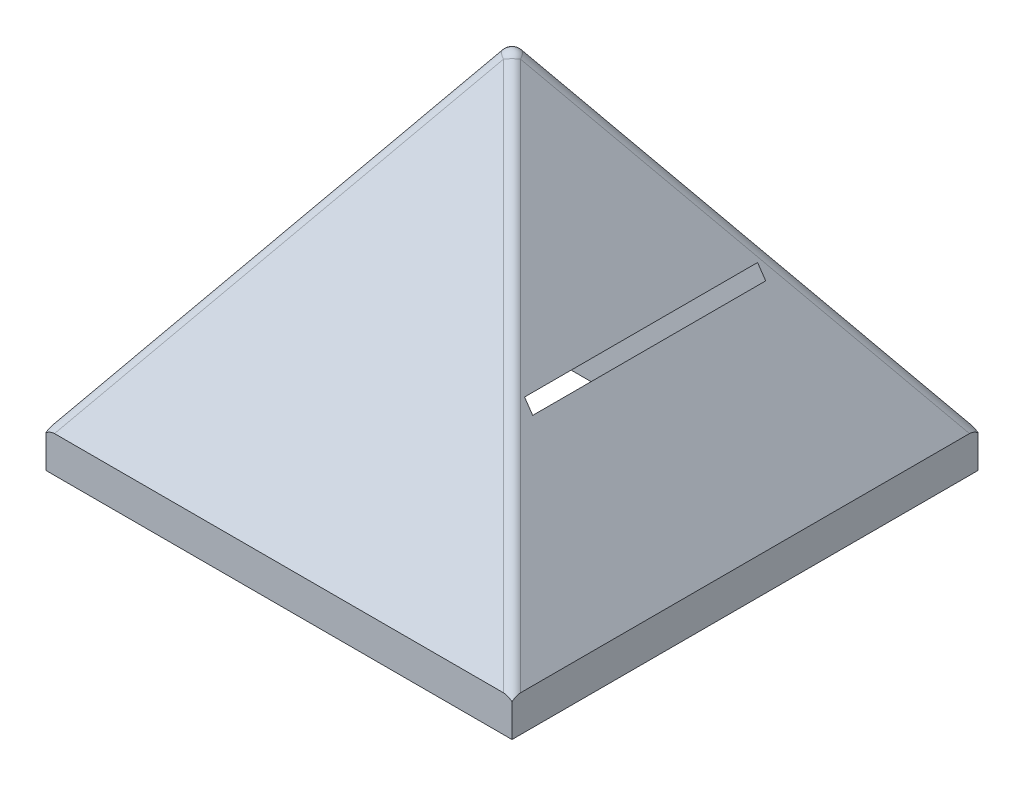
ISO-10303-21;
HEADER;
FILE_DESCRIPTION(('STEP AP214'),'2;1');
FILE_NAME('part.step','',(''),(''),'','','');
FILE_SCHEMA(('AUTOMOTIVE_DESIGN { 1 0 10303 214 1 1 1 1 }'));
ENDSEC;
DATA;
#1=APPLICATION_CONTEXT('core data for automotive mechanical design processes');
#2=APPLICATION_PROTOCOL_DEFINITION('international standard','automotive_design',2000,#1);
#3=PRODUCT_CONTEXT('',#1,'mechanical');
#4=PRODUCT('Part','Part','',(#3));
#5=PRODUCT_RELATED_PRODUCT_CATEGORY('part','',(#4));
#6=PRODUCT_DEFINITION_FORMATION('','',#4);
#7=PRODUCT_DEFINITION_CONTEXT('part definition',#1,'design');
#8=PRODUCT_DEFINITION('design','',#6,#7);
#9=PRODUCT_DEFINITION_SHAPE('','',#8);
#10=(LENGTH_UNIT() NAMED_UNIT(*) SI_UNIT(.MILLI.,.METRE.));
#11=(NAMED_UNIT(*) PLANE_ANGLE_UNIT() SI_UNIT($,.RADIAN.));
#12=(NAMED_UNIT(*) SI_UNIT($,.STERADIAN.) SOLID_ANGLE_UNIT());
#13=UNCERTAINTY_MEASURE_WITH_UNIT(LENGTH_MEASURE(1.E-05),#10,'distance_accuracy_value','');
#14=(GEOMETRIC_REPRESENTATION_CONTEXT(3) GLOBAL_UNCERTAINTY_ASSIGNED_CONTEXT((#13)) GLOBAL_UNIT_ASSIGNED_CONTEXT((#10,
#11,#12)) REPRESENTATION_CONTEXT('',''));
#15=CARTESIAN_POINT('',(0.,0.,0.));
#16=DIRECTION('',(0.,0.,1.));
#17=DIRECTION('',(1.,0.,0.));
#18=AXIS2_PLACEMENT_3D('',#15,#16,#17);
#19=CARTESIAN_POINT('',(-1143.,1828.8,-1143.));
#20=DIRECTION('',(0.,0.,1.));
#21=DIRECTION('',(1.,0.,0.));
#22=AXIS2_PLACEMENT_3D('',#19,#20,#21);
#23=PLANE('',#22);
#24=DIRECTION('',(-1.,0.,0.));
#25=VECTOR('',#24,1.);
#26=CARTESIAN_POINT('',(1143.,177.8,-1143.));
#27=LINE('',#26,#25);
#28=CARTESIAN_POINT('',(1101.2326366645,177.8,-1143.));
#29=VERTEX_POINT('',#28);
#30=CARTESIAN_POINT('',(-1101.2326366645,177.8,-1143.));
#31=VERTEX_POINT('',#30);
#32=EDGE_CURVE('E241',#29,#31,#27,.T.);
#33=ORIENTED_EDGE('',*,*,#32,.F.);
#34=CARTESIAN_POINT('',(1143.,88.5534971463589,-1143.));
#35=DIRECTION('',(0.,0.,1.));
#36=DIRECTION('',(-0.569209978830308,0.822192191643779,0.));
#37=AXIS2_PLACEMENT_3D('',#34,#35,#36);
#38=ELLIPSE('',#37,102.691666027993,50.8);
#39=CARTESIAN_POINT('',(1143.,161.167470566097,-1143.));
#40=VERTEX_POINT('',#39);
#41=EDGE_CURVE('E278',#29,#40,#38,.F.);
#42=ORIENTED_EDGE('',*,*,#41,.T.);
#43=DIRECTION('',(0.,-1.,0.));
#44=VECTOR('',#43,1.);
#45=CARTESIAN_POINT('',(1143.,1828.8,-1143.));
#46=LINE('',#45,#44);
#47=CARTESIAN_POINT('',(1143.,0.,-1143.));
#48=VERTEX_POINT('',#47);
#49=EDGE_CURVE('E267',#40,#48,#46,.T.);
#50=ORIENTED_EDGE('',*,*,#49,.T.);
#51=DIRECTION('',(-1.,0.,0.));
#52=VECTOR('',#51,1.);
#53=CARTESIAN_POINT('',(-1143.,0.,-1143.));
#54=LINE('',#53,#52);
#55=CARTESIAN_POINT('',(-1143.,0.,-1143.));
#56=VERTEX_POINT('',#55);
#57=EDGE_CURVE('E252',#48,#56,#54,.T.);
#58=ORIENTED_EDGE('',*,*,#57,.T.);
#59=DIRECTION('',(0.,-1.,0.));
#60=VECTOR('',#59,1.);
#61=CARTESIAN_POINT('',(-1143.,1828.8,-1143.));
#62=LINE('',#61,#60);
#63=CARTESIAN_POINT('',(-1143.,161.167470566097,-1143.));
#64=VERTEX_POINT('',#63);
#65=EDGE_CURVE('E265',#64,#56,#62,.T.);
#66=ORIENTED_EDGE('',*,*,#65,.F.);
#67=CARTESIAN_POINT('',(-1143.,88.5534971463589,-1143.));
#68=DIRECTION('',(0.,0.,1.));
#69=DIRECTION('',(-0.569209978830308,-0.822192191643779,0.));
#70=AXIS2_PLACEMENT_3D('',#67,#68,#69);
#71=ELLIPSE('',#70,102.691666027993,50.8);
#72=EDGE_CURVE('E276',#64,#31,#71,.F.);
#73=ORIENTED_EDGE('',*,*,#72,.T.);
#74=EDGE_LOOP('',(#33,#42,#50,#58,#66,#73));
#75=FACE_BOUND('',#74,.T.);
#76=ADVANCED_FACE('F69',(#75),#23,.F.);
#77=CARTESIAN_POINT('',(-855.8784,592.5312,-1143.));
#78=DIRECTION('',(-0.822192191643779,0.569209978830308,0.));
#79=DIRECTION('',(-0.569209978830308,-0.822192191643779,0.));
#80=AXIS2_PLACEMENT_3D('',#77,#78,#79);
#81=PLANE('',#80);
#82=DIRECTION('',(0.,0.,1.));
#83=VECTOR('',#82,1.);
#84=CARTESIAN_POINT('',(-673.1,856.544444444445,-1143.));
#85=LINE('',#84,#83);
#86=CARTESIAN_POINT('',(-673.1,856.544444444445,-571.5));
#87=VERTEX_POINT('',#86);
#88=CARTESIAN_POINT('',(-673.1,856.544444444445,571.5));
#89=VERTEX_POINT('',#88);
#90=EDGE_CURVE('E233',#87,#89,#85,.T.);
#91=ORIENTED_EDGE('',*,*,#90,.F.);
#92=DIRECTION('',(-0.569209978830308,-0.822192191643779,0.));
#93=VECTOR('',#92,1.);
#94=CARTESIAN_POINT('',(-855.8784,592.5312,-571.5));
#95=LINE('',#94,#93);
#96=CARTESIAN_POINT('',(-633.046153846154,914.4,-571.5));
#97=VERTEX_POINT('',#96);
#98=EDGE_CURVE('E224',#97,#87,#95,.T.);
#99=ORIENTED_EDGE('',*,*,#98,.F.);
#100=DIRECTION('',(0.,0.,1.));
#101=VECTOR('',#100,1.);
#102=CARTESIAN_POINT('',(-633.046153846154,914.4,-1143.));
#103=LINE('',#102,#101);
#104=CARTESIAN_POINT('',(-633.046153846154,914.4,571.5));
#105=VERTEX_POINT('',#104);
#106=EDGE_CURVE('E235',#97,#105,#103,.T.);
#107=ORIENTED_EDGE('',*,*,#106,.T.);
#108=DIRECTION('',(0.569209978830308,0.822192191643779,0.));
#109=VECTOR('',#108,1.);
#110=CARTESIAN_POINT('',(-855.8784,592.5312,571.5));
#111=LINE('',#110,#109);
#112=EDGE_CURVE('E230',#89,#105,#111,.T.);
#113=ORIENTED_EDGE('',*,*,#112,.F.);
#114=EDGE_LOOP('',(#91,#99,#107,#113));
#115=FACE_BOUND('',#114,.T.);
#116=DIRECTION('',(-0.494684738936381,-0.714544622908107,0.494684738936381));
#117=VECTOR('',#116,1.);
#118=CARTESIAN_POINT('',(-10.2210164053655,1814.03630963669,-31.5463469301387));
#119=LINE('',#118,#117);
#120=CARTESIAN_POINT('',(-1143.,177.8,1101.2326366645));
#121=VERTEX_POINT('',#120);
#122=CARTESIAN_POINT('',(-41.7673633355044,1768.46936407094,2.11914167990519E-13));
#123=VERTEX_POINT('',#122);
#124=EDGE_CURVE('E86',#121,#123,#119,.F.);
#125=ORIENTED_EDGE('',*,*,#124,.T.);
#126=DIRECTION('',(-0.494684738936382,-0.714544622908107,-0.494684738936381));
#127=VECTOR('',#126,1.);
#128=CARTESIAN_POINT('',(-936.361801903855,476.277397249988,-894.59443856835));
#129=LINE('',#128,#127);
#130=CARTESIAN_POINT('',(-1143.,177.8,-1101.2326366645));
#131=VERTEX_POINT('',#130);
#132=EDGE_CURVE('E297',#123,#131,#129,.T.);
#133=ORIENTED_EDGE('',*,*,#132,.T.);
#134=DIRECTION('',(0.,0.,1.));
#135=VECTOR('',#134,1.);
#136=CARTESIAN_POINT('',(-1143.,177.8,-1143.));
#137=LINE('',#136,#135);
#138=EDGE_CURVE('E247',#131,#121,#137,.T.);
#139=ORIENTED_EDGE('',*,*,#138,.T.);
#140=EDGE_LOOP('',(#125,#133,#139));
#141=FACE_BOUND('',#140,.T.);
#142=ADVANCED_FACE('F330',(#115,#141),#81,.T.);
#143=CARTESIAN_POINT('',(855.8784,592.5312,-1143.));
#144=DIRECTION('',(-0.822192191643779,-0.569209978830308,0.));
#145=DIRECTION('',(0.569209978830308,-0.822192191643779,0.));
#146=AXIS2_PLACEMENT_3D('',#143,#144,#145);
#147=PLANE('',#146);
#148=DIRECTION('',(0.,0.,1.));
#149=VECTOR('',#148,1.);
#150=CARTESIAN_POINT('',(673.1,856.544444444444,-1143.));
#151=LINE('',#150,#149);
#152=CARTESIAN_POINT('',(673.1,856.544444444444,-571.5));
#153=VERTEX_POINT('',#152);
#154=CARTESIAN_POINT('',(673.1,856.544444444444,571.5));
#155=VERTEX_POINT('',#154);
#156=EDGE_CURVE('E192',#153,#155,#151,.T.);
#157=ORIENTED_EDGE('',*,*,#156,.T.);
#158=DIRECTION('',(-0.569209978830308,0.822192191643779,0.));
#159=VECTOR('',#158,1.);
#160=CARTESIAN_POINT('',(855.8784,592.5312,571.5));
#161=LINE('',#160,#159);
#162=CARTESIAN_POINT('',(633.046153846154,914.4,571.5));
#163=VERTEX_POINT('',#162);
#164=EDGE_CURVE('E227',#155,#163,#161,.T.);
#165=ORIENTED_EDGE('',*,*,#164,.T.);
#166=DIRECTION('',(0.,0.,1.));
#167=VECTOR('',#166,1.);
#168=CARTESIAN_POINT('',(633.046153846154,914.4,-1143.));
#169=LINE('',#168,#167);
#170=CARTESIAN_POINT('',(633.046153846154,914.4,-571.5));
#171=VERTEX_POINT('',#170);
#172=EDGE_CURVE('E269',#171,#163,#169,.T.);
#173=ORIENTED_EDGE('',*,*,#172,.F.);
#174=DIRECTION('',(0.569209978830308,-0.822192191643779,0.));
#175=VECTOR('',#174,1.);
#176=CARTESIAN_POINT('',(855.8784,592.5312,-571.5));
#177=LINE('',#176,#175);
#178=EDGE_CURVE('E219',#171,#153,#177,.T.);
#179=ORIENTED_EDGE('',*,*,#178,.T.);
#180=EDGE_LOOP('',(#157,#165,#173,#179));
#181=FACE_BOUND('',#180,.T.);
#182=DIRECTION('',(0.,0.,1.));
#183=VECTOR('',#182,1.);
#184=CARTESIAN_POINT('',(1143.,177.8,-1143.));
#185=LINE('',#184,#183);
#186=CARTESIAN_POINT('',(1143.,177.8,-1101.2326366645));
#187=VERTEX_POINT('',#186);
#188=CARTESIAN_POINT('',(1143.,177.8,1101.2326366645));
#189=VERTEX_POINT('',#188);
#190=EDGE_CURVE('E244',#187,#189,#185,.T.);
#191=ORIENTED_EDGE('',*,*,#190,.F.);
#192=DIRECTION('',(0.494684738936381,-0.714544622908107,-0.494684738936381));
#193=VECTOR('',#192,1.);
#194=CARTESIAN_POINT('',(10.2210164053649,1814.0363096367,31.546346930139));
#195=LINE('',#194,#193);
#196=CARTESIAN_POINT('',(41.7673633355036,1768.46936407094,3.24601045405236E-13));
#197=VERTEX_POINT('',#196);
#198=EDGE_CURVE('E286',#187,#197,#195,.F.);
#199=ORIENTED_EDGE('',*,*,#198,.T.);
#200=DIRECTION('',(0.494684738936382,-0.714544622908107,0.494684738936381));
#201=VECTOR('',#200,1.);
#202=CARTESIAN_POINT('',(376.947904622888,1284.3196933225,335.180541287384));
#203=LINE('',#202,#201);
#204=EDGE_CURVE('E284',#197,#189,#203,.T.);
#205=ORIENTED_EDGE('',*,*,#204,.T.);
#206=EDGE_LOOP('',(#191,#199,#205));
#207=FACE_BOUND('',#206,.T.);
#208=ADVANCED_FACE('F322',(#181,#207),#147,.F.);
#209=CARTESIAN_POINT('',(-1143.,1828.8,1143.));
#210=DIRECTION('',(1.,0.,0.));
#211=DIRECTION('',(0.,0.,-1.));
#212=AXIS2_PLACEMENT_3D('',#209,#210,#211);
#213=PLANE('',#212);
#214=ORIENTED_EDGE('',*,*,#138,.F.);
#215=CARTESIAN_POINT('',(-1143.,88.5534971463589,-1143.));
#216=DIRECTION('',(1.,0.,0.));
#217=DIRECTION('',(0.,-0.822192191643779,-0.569209978830308));
#218=AXIS2_PLACEMENT_3D('',#215,#216,#217);
#219=ELLIPSE('',#218,102.691666027993,50.8);
#220=EDGE_CURVE('E12',#131,#64,#219,.F.);
#221=ORIENTED_EDGE('',*,*,#220,.T.);
#222=ORIENTED_EDGE('',*,*,#65,.T.);
#223=DIRECTION('',(0.,0.,1.));
#224=VECTOR('',#223,1.);
#225=CARTESIAN_POINT('',(-1143.,0.,1143.));
#226=LINE('',#225,#224);
#227=CARTESIAN_POINT('',(-1143.,0.,1143.));
#228=VERTEX_POINT('',#227);
#229=EDGE_CURVE('E255',#56,#228,#226,.T.);
#230=ORIENTED_EDGE('',*,*,#229,.T.);
#231=DIRECTION('',(0.,-1.,0.));
#232=VECTOR('',#231,1.);
#233=CARTESIAN_POINT('',(-1143.,1828.8,1143.));
#234=LINE('',#233,#232);
#235=CARTESIAN_POINT('',(-1143.,161.167470566097,1143.));
#236=VERTEX_POINT('',#235);
#237=EDGE_CURVE('E263',#236,#228,#234,.T.);
#238=ORIENTED_EDGE('',*,*,#237,.F.);
#239=CARTESIAN_POINT('',(-1143.,88.5534971463584,1143.));
#240=DIRECTION('',(1.,0.,0.));
#241=DIRECTION('',(0.,0.822192191643779,-0.569209978830308));
#242=AXIS2_PLACEMENT_3D('',#239,#240,#241);
#243=ELLIPSE('',#242,102.691666027993,50.8);
#244=EDGE_CURVE('E78',#236,#121,#243,.F.);
#245=ORIENTED_EDGE('',*,*,#244,.T.);
#246=EDGE_LOOP('',(#214,#221,#222,#230,#238,#245));
#247=FACE_BOUND('',#246,.T.);
#248=ADVANCED_FACE('F352',(#247),#213,.F.);
#249=CARTESIAN_POINT('',(-1143.,1828.8,1143.));
#250=DIRECTION('',(0.,0.,-1.));
#251=DIRECTION('',(-1.,0.,0.));
#252=AXIS2_PLACEMENT_3D('',#249,#250,#251);
#253=PLANE('',#252);
#254=DIRECTION('',(0.,-1.,0.));
#255=VECTOR('',#254,1.);
#256=CARTESIAN_POINT('',(1143.,1828.8,1143.));
#257=LINE('',#256,#255);
#258=CARTESIAN_POINT('',(1143.,161.167470566097,1143.));
#259=VERTEX_POINT('',#258);
#260=CARTESIAN_POINT('',(1143.,0.,1143.));
#261=VERTEX_POINT('',#260);
#262=EDGE_CURVE('E261',#259,#261,#257,.T.);
#263=ORIENTED_EDGE('',*,*,#262,.F.);
#264=CARTESIAN_POINT('',(1143.,88.5534971463589,1143.));
#265=DIRECTION('',(0.,0.,-1.));
#266=DIRECTION('',(0.569209978830308,-0.822192191643779,0.));
#267=AXIS2_PLACEMENT_3D('',#264,#265,#266);
#268=ELLIPSE('',#267,102.691666027993,50.8);
#269=CARTESIAN_POINT('',(1101.2326366645,177.8,1143.));
#270=VERTEX_POINT('',#269);
#271=EDGE_CURVE('E290',#259,#270,#268,.F.);
#272=ORIENTED_EDGE('',*,*,#271,.T.);
#273=DIRECTION('',(-1.,0.,0.));
#274=VECTOR('',#273,1.);
#275=CARTESIAN_POINT('',(1143.,177.8,1143.));
#276=LINE('',#275,#274);
#277=CARTESIAN_POINT('',(-1101.2326366645,177.8,1143.));
#278=VERTEX_POINT('',#277);
#279=EDGE_CURVE('E238',#270,#278,#276,.T.);
#280=ORIENTED_EDGE('',*,*,#279,.T.);
#281=CARTESIAN_POINT('',(-1143.,88.5534971463584,1143.));
#282=DIRECTION('',(0.,0.,-1.));
#283=DIRECTION('',(0.569209978830308,0.822192191643779,0.));
#284=AXIS2_PLACEMENT_3D('',#281,#282,#283);
#285=ELLIPSE('',#284,102.691666027993,50.8);
#286=EDGE_CURVE('E288',#278,#236,#285,.F.);
#287=ORIENTED_EDGE('',*,*,#286,.T.);
#288=ORIENTED_EDGE('',*,*,#237,.T.);
#289=DIRECTION('',(1.,0.,0.));
#290=VECTOR('',#289,1.);
#291=CARTESIAN_POINT('',(-1143.,0.,1143.));
#292=LINE('',#291,#290);
#293=EDGE_CURVE('E258',#228,#261,#292,.T.);
#294=ORIENTED_EDGE('',*,*,#293,.T.);
#295=EDGE_LOOP('',(#263,#272,#280,#287,#288,#294));
#296=FACE_BOUND('',#295,.T.);
#297=ADVANCED_FACE('F357',(#296),#253,.F.);
#298=CARTESIAN_POINT('',(1143.,1828.8,1143.));
#299=DIRECTION('',(-1.,0.,0.));
#300=DIRECTION('',(0.,0.,1.));
#301=AXIS2_PLACEMENT_3D('',#298,#299,#300);
#302=PLANE('',#301);
#303=ORIENTED_EDGE('',*,*,#49,.F.);
#304=CARTESIAN_POINT('',(1143.,88.5534971463589,-1143.));
#305=DIRECTION('',(-1.,0.,0.));
#306=DIRECTION('',(0.,0.822192191643779,0.569209978830308));
#307=AXIS2_PLACEMENT_3D('',#304,#305,#306);
#308=ELLIPSE('',#307,102.691666027993,50.8);
#309=EDGE_CURVE('E282',#40,#187,#308,.F.);
#310=ORIENTED_EDGE('',*,*,#309,.T.);
#311=ORIENTED_EDGE('',*,*,#190,.T.);
#312=CARTESIAN_POINT('',(1143.,88.5534971463589,1143.));
#313=DIRECTION('',(-1.,0.,0.));
#314=DIRECTION('',(0.,-0.822192191643779,0.569209978830308));
#315=AXIS2_PLACEMENT_3D('',#312,#313,#314);
#316=ELLIPSE('',#315,102.691666027993,50.8);
#317=EDGE_CURVE('E280',#189,#259,#316,.F.);
#318=ORIENTED_EDGE('',*,*,#317,.T.);
#319=ORIENTED_EDGE('',*,*,#262,.T.);
#320=DIRECTION('',(0.,0.,-1.));
#321=VECTOR('',#320,1.);
#322=CARTESIAN_POINT('',(1143.,0.,1143.));
#323=LINE('',#322,#321);
#324=EDGE_CURVE('E249',#261,#48,#323,.T.);
#325=ORIENTED_EDGE('',*,*,#324,.T.);
#326=EDGE_LOOP('',(#303,#310,#311,#318,#319,#325));
#327=FACE_BOUND('',#326,.T.);
#328=ADVANCED_FACE('F354',(#327),#302,.F.);
#329=CARTESIAN_POINT('',(0.,0.,0.));
#330=DIRECTION('',(0.,-1.,0.));
#331=DIRECTION('',(0.,0.,-1.));
#332=AXIS2_PLACEMENT_3D('',#329,#330,#331);
#333=PLANE('',#332);
#334=DIRECTION('',(0.,0.,-1.));
#335=VECTOR('',#334,1.);
#336=CARTESIAN_POINT('',(-673.1,0.,-571.5));
#337=LINE('',#336,#335);
#338=CARTESIAN_POINT('',(-673.1,0.,571.5));
#339=VERTEX_POINT('',#338);
#340=CARTESIAN_POINT('',(-673.1,0.,-571.5));
#341=VERTEX_POINT('',#340);
#342=EDGE_CURVE('E206',#339,#341,#337,.T.);
#343=ORIENTED_EDGE('',*,*,#342,.F.);
#344=DIRECTION('',(-1.,0.,0.));
#345=VECTOR('',#344,1.);
#346=CARTESIAN_POINT('',(673.1,0.,571.5));
#347=LINE('',#346,#345);
#348=CARTESIAN_POINT('',(673.1,0.,571.5));
#349=VERTEX_POINT('',#348);
#350=EDGE_CURVE('E211',#349,#339,#347,.T.);
#351=ORIENTED_EDGE('',*,*,#350,.F.);
#352=DIRECTION('',(0.,0.,1.));
#353=VECTOR('',#352,1.);
#354=CARTESIAN_POINT('',(673.1,0.,-571.5));
#355=LINE('',#354,#353);
#356=CARTESIAN_POINT('',(673.1,0.,-571.5));
#357=VERTEX_POINT('',#356);
#358=EDGE_CURVE('E189',#357,#349,#355,.T.);
#359=ORIENTED_EDGE('',*,*,#358,.F.);
#360=DIRECTION('',(1.,0.,0.));
#361=VECTOR('',#360,1.);
#362=CARTESIAN_POINT('',(673.1,0.,-571.5));
#363=LINE('',#362,#361);
#364=EDGE_CURVE('E201',#341,#357,#363,.T.);
#365=ORIENTED_EDGE('',*,*,#364,.F.);
#366=EDGE_LOOP('',(#343,#351,#359,#365));
#367=FACE_BOUND('',#366,.T.);
#368=ORIENTED_EDGE('',*,*,#324,.F.);
#369=ORIENTED_EDGE('',*,*,#293,.F.);
#370=ORIENTED_EDGE('',*,*,#229,.F.);
#371=ORIENTED_EDGE('',*,*,#57,.F.);
#372=EDGE_LOOP('',(#368,#369,#370,#371));
#373=FACE_BOUND('',#372,.T.);
#374=ADVANCED_FACE('F208',(#367,#373),#333,.T.);
#375=CARTESIAN_POINT('',(1143.,592.5312,-855.8784));
#376=DIRECTION('',(0.,0.569209978830308,-0.822192191643779));
#377=DIRECTION('',(0.,0.822192191643779,0.569209978830308));
#378=AXIS2_PLACEMENT_3D('',#375,#376,#377);
#379=PLANE('',#378);
#380=DIRECTION('',(-0.494684738936381,-0.714544622908107,-0.494684738936381));
#381=VECTOR('',#380,1.);
#382=CARTESIAN_POINT('',(-335.180541287384,1284.3196933225,-376.947904622888));
#383=LINE('',#382,#381);
#384=CARTESIAN_POINT('',(-2.08796968477753E-13,1768.46936407094,-41.7673633355037));
#385=VERTEX_POINT('',#384);
#386=EDGE_CURVE('E271',#31,#385,#383,.F.);
#387=ORIENTED_EDGE('',*,*,#386,.T.);
#388=DIRECTION('',(0.494684738936381,-0.714544622908107,-0.494684738936381));
#389=VECTOR('',#388,1.);
#390=CARTESIAN_POINT('',(1111.45365306986,163.036309636695,-1153.22101640536));
#391=LINE('',#390,#389);
#392=EDGE_CURVE('E273',#385,#29,#391,.T.);
#393=ORIENTED_EDGE('',*,*,#392,.T.);
#394=ORIENTED_EDGE('',*,*,#32,.T.);
#395=EDGE_LOOP('',(#387,#393,#394));
#396=FACE_BOUND('',#395,.T.);
#397=ADVANCED_FACE('F390',(#396),#379,.T.);
#398=CARTESIAN_POINT('',(1143.,592.5312,855.8784));
#399=DIRECTION('',(0.,-0.569209978830308,-0.822192191643779));
#400=DIRECTION('',(0.,0.822192191643779,-0.569209978830308));
#401=AXIS2_PLACEMENT_3D('',#398,#399,#400);
#402=PLANE('',#401);
#403=ORIENTED_EDGE('',*,*,#279,.F.);
#404=DIRECTION('',(0.494684738936381,-0.714544622908107,0.494684738936381));
#405=VECTOR('',#404,1.);
#406=CARTESIAN_POINT('',(894.59443856835,476.277397249988,936.361801903855));
#407=LINE('',#406,#405);
#408=CARTESIAN_POINT('',(0.,1768.46936407094,41.7673633355043));
#409=VERTEX_POINT('',#408);
#410=EDGE_CURVE('E294',#270,#409,#407,.F.);
#411=ORIENTED_EDGE('',*,*,#410,.T.);
#412=DIRECTION('',(-0.494684738936381,-0.714544622908107,0.494684738936381));
#413=VECTOR('',#412,1.);
#414=CARTESIAN_POINT('',(-1111.45365306986,163.036309636695,1153.22101640537));
#415=LINE('',#414,#413);
#416=EDGE_CURVE('E292',#409,#278,#415,.T.);
#417=ORIENTED_EDGE('',*,*,#416,.T.);
#418=EDGE_LOOP('',(#403,#411,#417));
#419=FACE_BOUND('',#418,.T.);
#420=ADVANCED_FACE('F388',(#419),#402,.F.);
#421=CARTESIAN_POINT('',(0.,914.4,0.));
#422=DIRECTION('',(0.,-1.,0.));
#423=DIRECTION('',(0.,0.,-1.));
#424=AXIS2_PLACEMENT_3D('',#421,#422,#423);
#425=PLANE('',#424);
#426=DIRECTION('',(1.,0.,0.));
#427=VECTOR('',#426,1.);
#428=CARTESIAN_POINT('',(673.1,914.4,-571.5));
#429=LINE('',#428,#427);
#430=EDGE_CURVE('E213',#97,#171,#429,.T.);
#431=ORIENTED_EDGE('',*,*,#430,.T.);
#432=ORIENTED_EDGE('',*,*,#172,.T.);
#433=DIRECTION('',(-1.,0.,0.));
#434=VECTOR('',#433,1.);
#435=CARTESIAN_POINT('',(673.1,914.4,571.5));
#436=LINE('',#435,#434);
#437=EDGE_CURVE('E222',#163,#105,#436,.T.);
#438=ORIENTED_EDGE('',*,*,#437,.T.);
#439=ORIENTED_EDGE('',*,*,#106,.F.);
#440=EDGE_LOOP('',(#431,#432,#438,#439));
#441=FACE_BOUND('',#440,.T.);
#442=ADVANCED_FACE('F317',(#441),#425,.T.);
#443=CARTESIAN_POINT('',(673.1,914.4,571.5));
#444=DIRECTION('',(0.,0.,1.));
#445=DIRECTION('',(1.,0.,0.));
#446=AXIS2_PLACEMENT_3D('',#443,#444,#445);
#447=PLANE('',#446);
#448=ORIENTED_EDGE('',*,*,#112,.T.);
#449=ORIENTED_EDGE('',*,*,#437,.F.);
#450=ORIENTED_EDGE('',*,*,#164,.F.);
#451=DIRECTION('',(0.,-1.,0.));
#452=VECTOR('',#451,1.);
#453=CARTESIAN_POINT('',(673.1,914.4,571.5));
#454=LINE('',#453,#452);
#455=EDGE_CURVE('E196',#155,#349,#454,.T.);
#456=ORIENTED_EDGE('',*,*,#455,.T.);
#457=ORIENTED_EDGE('',*,*,#350,.T.);
#458=DIRECTION('',(0.,-1.,0.));
#459=VECTOR('',#458,1.);
#460=CARTESIAN_POINT('',(-673.1,914.4,571.5));
#461=LINE('',#460,#459);
#462=EDGE_CURVE('E217',#89,#339,#461,.T.);
#463=ORIENTED_EDGE('',*,*,#462,.F.);
#464=EDGE_LOOP('',(#448,#449,#450,#456,#457,#463));
#465=FACE_BOUND('',#464,.T.);
#466=ADVANCED_FACE('F325',(#465),#447,.F.);
#467=CARTESIAN_POINT('',(673.1,914.4,-571.5));
#468=DIRECTION('',(1.,0.,0.));
#469=DIRECTION('',(0.,0.,-1.));
#470=AXIS2_PLACEMENT_3D('',#467,#468,#469);
#471=PLANE('',#470);
#472=DIRECTION('',(0.,-1.,0.));
#473=VECTOR('',#472,1.);
#474=CARTESIAN_POINT('',(673.1,914.4,-571.5));
#475=LINE('',#474,#473);
#476=EDGE_CURVE('E184',#153,#357,#475,.T.);
#477=ORIENTED_EDGE('',*,*,#476,.T.);
#478=ORIENTED_EDGE('',*,*,#358,.T.);
#479=ORIENTED_EDGE('',*,*,#455,.F.);
#480=ORIENTED_EDGE('',*,*,#156,.F.);
#481=EDGE_LOOP('',(#477,#478,#479,#480));
#482=FACE_BOUND('',#481,.T.);
#483=ADVANCED_FACE('F186',(#482),#471,.F.);
#484=CARTESIAN_POINT('',(673.1,914.4,-571.5));
#485=DIRECTION('',(0.,0.,-1.));
#486=DIRECTION('',(-1.,0.,0.));
#487=AXIS2_PLACEMENT_3D('',#484,#485,#486);
#488=PLANE('',#487);
#489=ORIENTED_EDGE('',*,*,#98,.T.);
#490=DIRECTION('',(0.,-1.,0.));
#491=VECTOR('',#490,1.);
#492=CARTESIAN_POINT('',(-673.1,914.4,-571.5));
#493=LINE('',#492,#491);
#494=EDGE_CURVE('E197',#87,#341,#493,.T.);
#495=ORIENTED_EDGE('',*,*,#494,.T.);
#496=ORIENTED_EDGE('',*,*,#364,.T.);
#497=ORIENTED_EDGE('',*,*,#476,.F.);
#498=ORIENTED_EDGE('',*,*,#178,.F.);
#499=ORIENTED_EDGE('',*,*,#430,.F.);
#500=EDGE_LOOP('',(#489,#495,#496,#497,#498,#499));
#501=FACE_BOUND('',#500,.T.);
#502=ADVANCED_FACE('F202',(#501),#488,.F.);
#503=CARTESIAN_POINT('',(-673.1,914.4,-571.5));
#504=DIRECTION('',(-1.,0.,0.));
#505=DIRECTION('',(0.,0.,1.));
#506=AXIS2_PLACEMENT_3D('',#503,#504,#505);
#507=PLANE('',#506);
#508=ORIENTED_EDGE('',*,*,#90,.T.);
#509=ORIENTED_EDGE('',*,*,#462,.T.);
#510=ORIENTED_EDGE('',*,*,#342,.T.);
#511=ORIENTED_EDGE('',*,*,#494,.F.);
#512=EDGE_LOOP('',(#508,#509,#510,#511));
#513=FACE_BOUND('',#512,.T.);
#514=ADVANCED_FACE('F331',(#513),#507,.F.);
#515=CARTESIAN_POINT('',(335.180541287384,1255.40382639792,335.180541287384));
#516=DIRECTION('',(0.494684738936381,-0.714544622908107,0.494684738936381));
#517=DIRECTION('',(0.,-0.569209978830308,-0.822192191643779));
#518=AXIS2_PLACEMENT_3D('',#515,#516,#517);
#519=CYLINDRICAL_SURFACE('',#518,50.8);
#520=ORIENTED_EDGE('',*,*,#317,.F.);
#521=ORIENTED_EDGE('',*,*,#204,.F.);
#522=CARTESIAN_POINT('',(0.,1739.55349714636,3.67761376907083E-13));
#523=DIRECTION('',(-0.49468473893639,0.714544622908102,-0.494684738936379));
#524=DIRECTION('',(-0.822192191643772,-0.569209978830318,0.));
#525=AXIS2_PLACEMENT_3D('',#522,#523,#524);
#526=CIRCLE('',#525,50.8);
#527=EDGE_CURVE('E73',#409,#197,#526,.T.);
#528=ORIENTED_EDGE('',*,*,#527,.F.);
#529=ORIENTED_EDGE('',*,*,#410,.F.);
#530=ORIENTED_EDGE('',*,*,#271,.F.);
#531=EDGE_LOOP('',(#520,#521,#528,#529,#530));
#532=FACE_BOUND('',#531,.T.);
#533=ADVANCED_FACE('F71',(#532),#519,.T.);
#534=CARTESIAN_POINT('',(-335.180541287384,1255.40382639792,335.180541287384));
#535=DIRECTION('',(0.494684738936381,0.714544622908107,-0.494684738936381));
#536=DIRECTION('',(0.,0.569209978830308,0.822192191643779));
#537=AXIS2_PLACEMENT_3D('',#534,#535,#536);
#538=CYLINDRICAL_SURFACE('',#537,50.8);
#539=ORIENTED_EDGE('',*,*,#286,.F.);
#540=ORIENTED_EDGE('',*,*,#416,.F.);
#541=CARTESIAN_POINT('',(-4.16333634234434E-13,1739.55349714636,2.11914167990519E-13));
#542=DIRECTION('',(0.494684738936381,0.714544622908105,-0.494684738936383));
#543=DIRECTION('',(0.,0.56920997883031,0.822192191643777));
#544=AXIS2_PLACEMENT_3D('',#541,#542,#543);
#545=CIRCLE('',#544,50.8);
#546=EDGE_CURVE('E305',#123,#409,#545,.T.);
#547=ORIENTED_EDGE('',*,*,#546,.F.);
#548=ORIENTED_EDGE('',*,*,#124,.F.);
#549=ORIENTED_EDGE('',*,*,#244,.F.);
#550=EDGE_LOOP('',(#539,#540,#547,#548,#549));
#551=FACE_BOUND('',#550,.T.);
#552=ADVANCED_FACE('F338',(#551),#538,.T.);
#553=CARTESIAN_POINT('',(-894.594438568351,447.361530325408,-894.59443856835));
#554=DIRECTION('',(-0.494684738936381,-0.714544622908107,-0.494684738936381));
#555=DIRECTION('',(0.,0.569209978830308,-0.822192191643779));
#556=AXIS2_PLACEMENT_3D('',#553,#554,#555);
#557=CYLINDRICAL_SURFACE('',#556,50.8);
#558=ORIENTED_EDGE('',*,*,#220,.F.);
#559=ORIENTED_EDGE('',*,*,#132,.F.);
#560=CARTESIAN_POINT('',(-2.08796968477753E-13,1739.55349714636,2.91433543964104E-13));
#561=DIRECTION('',(0.494684738936375,0.714544622908109,0.494684738936384));
#562=DIRECTION('',(0.,-0.569209978830309,0.822192191643778));
#563=AXIS2_PLACEMENT_3D('',#560,#561,#562);
#564=CIRCLE('',#563,50.8);
#565=EDGE_CURVE('E303',#385,#123,#564,.T.);
#566=ORIENTED_EDGE('',*,*,#565,.F.);
#567=ORIENTED_EDGE('',*,*,#386,.F.);
#568=ORIENTED_EDGE('',*,*,#72,.F.);
#569=EDGE_LOOP('',(#558,#559,#566,#567,#568));
#570=FACE_BOUND('',#569,.T.);
#571=ADVANCED_FACE('F366',(#570),#557,.T.);
#572=CARTESIAN_POINT('',(0.,1739.55349714636,0.));
#573=DIRECTION('',(0.,0.,1.));
#574=DIRECTION('',(1.,0.,0.));
#575=AXIS2_PLACEMENT_3D('',#572,#573,#574);
#576=SPHERICAL_SURFACE('',#575,50.8);
#577=ORIENTED_EDGE('',*,*,#546,.T.);
#578=ORIENTED_EDGE('',*,*,#527,.T.);
#579=CARTESIAN_POINT('',(-3.60822483003176E-13,1739.55349714636,3.24601045405236E-13));
#580=DIRECTION('',(-0.494684738936383,0.714544622908108,0.494684738936378));
#581=DIRECTION('',(-0.822192191643778,-0.569209978830309,0.));
#582=AXIS2_PLACEMENT_3D('',#579,#580,#581);
#583=CIRCLE('',#582,50.8);
#584=EDGE_CURVE('E300',#385,#197,#583,.F.);
#585=ORIENTED_EDGE('',*,*,#584,.F.);
#586=ORIENTED_EDGE('',*,*,#565,.T.);
#587=EDGE_LOOP('',(#577,#578,#585,#586));
#588=FACE_BOUND('',#587,.T.);
#589=ADVANCED_FACE('F362',(#588),#576,.T.);
#590=CARTESIAN_POINT('',(894.59443856835,447.361530325408,-894.59443856835));
#591=DIRECTION('',(-0.494684738936381,0.714544622908107,0.494684738936381));
#592=DIRECTION('',(0.,-0.569209978830308,0.822192191643779));
#593=AXIS2_PLACEMENT_3D('',#590,#591,#592);
#594=CYLINDRICAL_SURFACE('',#593,50.8);
#595=ORIENTED_EDGE('',*,*,#584,.T.);
#596=ORIENTED_EDGE('',*,*,#198,.F.);
#597=ORIENTED_EDGE('',*,*,#309,.F.);
#598=ORIENTED_EDGE('',*,*,#41,.F.);
#599=ORIENTED_EDGE('',*,*,#392,.F.);
#600=EDGE_LOOP('',(#595,#596,#597,#598,#599));
#601=FACE_BOUND('',#600,.T.);
#602=ADVANCED_FACE('F359',(#601),#594,.T.);
#603=CLOSED_SHELL('',(#76,#142,#208,#248,#297,#328,#374,#397,#420,#442,#466,#483,#502,#514,#533,
#552,#571,#589,#602));
#604=MANIFOLD_SOLID_BREP('B2',#603);
#605=ADVANCED_BREP_SHAPE_REPRESENTATION('',(#18,#604),#14);
#606=SHAPE_DEFINITION_REPRESENTATION(#9,#605);
ENDSEC;
END-ISO-10303-21;
